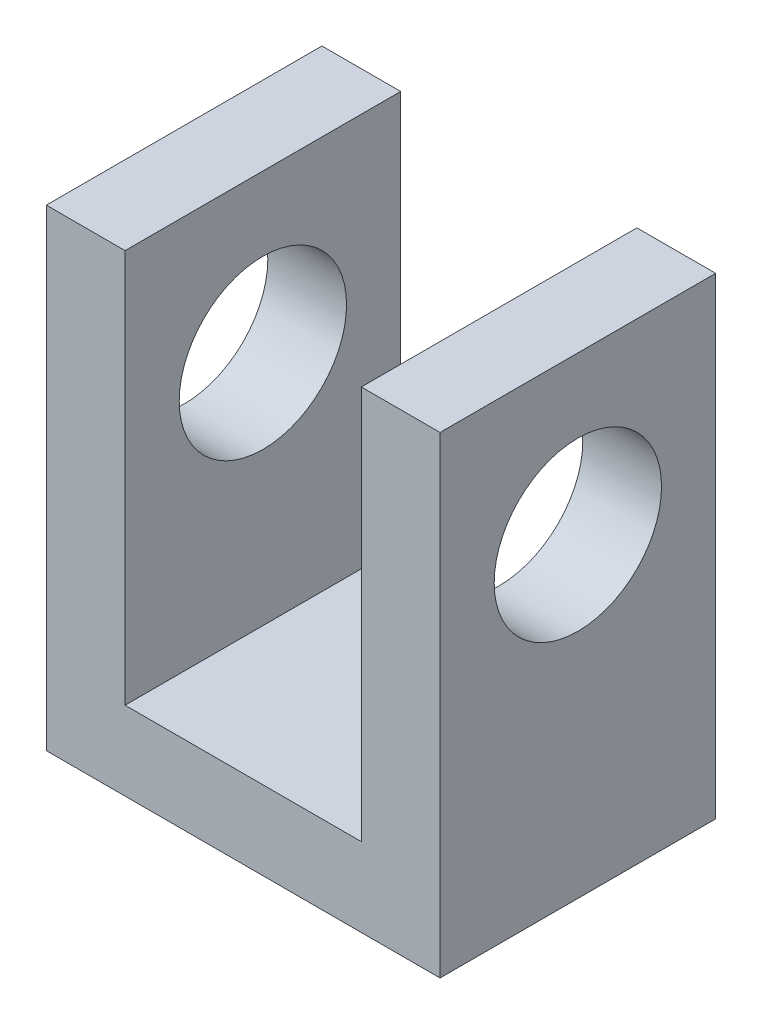
ISO-10303-21;
HEADER;
FILE_DESCRIPTION(('STEP AP214'),'2;1');
FILE_NAME('part.step','',(''),(''),'','','');
FILE_SCHEMA(('AUTOMOTIVE_DESIGN { 1 0 10303 214 1 1 1 1 }'));
ENDSEC;
DATA;
#1=APPLICATION_CONTEXT('core data for automotive mechanical design processes');
#2=APPLICATION_PROTOCOL_DEFINITION('international standard','automotive_design',2000,#1);
#3=PRODUCT_CONTEXT('',#1,'mechanical');
#4=PRODUCT('Part','Part','',(#3));
#5=PRODUCT_RELATED_PRODUCT_CATEGORY('part','',(#4));
#6=PRODUCT_DEFINITION_FORMATION('','',#4);
#7=PRODUCT_DEFINITION_CONTEXT('part definition',#1,'design');
#8=PRODUCT_DEFINITION('design','',#6,#7);
#9=PRODUCT_DEFINITION_SHAPE('','',#8);
#10=(LENGTH_UNIT() NAMED_UNIT(*) SI_UNIT(.MILLI.,.METRE.));
#11=(NAMED_UNIT(*) PLANE_ANGLE_UNIT() SI_UNIT($,.RADIAN.));
#12=(NAMED_UNIT(*) SI_UNIT($,.STERADIAN.) SOLID_ANGLE_UNIT());
#13=UNCERTAINTY_MEASURE_WITH_UNIT(LENGTH_MEASURE(1.E-05),#10,'distance_accuracy_value','');
#14=(GEOMETRIC_REPRESENTATION_CONTEXT(3) GLOBAL_UNCERTAINTY_ASSIGNED_CONTEXT((#13)) GLOBAL_UNIT_ASSIGNED_CONTEXT((#10,
#11,#12)) REPRESENTATION_CONTEXT('',''));
#15=CARTESIAN_POINT('',(0.,0.,0.));
#16=DIRECTION('',(0.,0.,1.));
#17=DIRECTION('',(1.,0.,0.));
#18=AXIS2_PLACEMENT_3D('',#15,#16,#17);
#19=CARTESIAN_POINT('',(0.,12.,0.));
#20=DIRECTION('',(0.,0.,-1.));
#21=DIRECTION('',(-1.,0.,0.));
#22=AXIS2_PLACEMENT_3D('',#19,#20,#21);
#23=PLANE('',#22);
#24=DIRECTION('',(0.,1.,0.));
#25=VECTOR('',#24,1.);
#26=CARTESIAN_POINT('',(8.,2.,0.));
#27=LINE('',#26,#25);
#28=CARTESIAN_POINT('',(8.,2.,0.));
#29=VERTEX_POINT('',#28);
#30=CARTESIAN_POINT('',(8.,12.,0.));
#31=VERTEX_POINT('',#30);
#32=EDGE_CURVE('E126',#29,#31,#27,.T.);
#33=ORIENTED_EDGE('',*,*,#32,.F.);
#34=DIRECTION('',(1.,0.,0.));
#35=VECTOR('',#34,1.);
#36=CARTESIAN_POINT('',(0.,2.,0.));
#37=LINE('',#36,#35);
#38=CARTESIAN_POINT('',(2.,2.,0.));
#39=VERTEX_POINT('',#38);
#40=EDGE_CURVE('E114',#39,#29,#37,.T.);
#41=ORIENTED_EDGE('',*,*,#40,.F.);
#42=DIRECTION('',(0.,1.,0.));
#43=VECTOR('',#42,1.);
#44=CARTESIAN_POINT('',(2.,2.,0.));
#45=LINE('',#44,#43);
#46=CARTESIAN_POINT('',(2.,12.,0.));
#47=VERTEX_POINT('',#46);
#48=EDGE_CURVE('E110',#39,#47,#45,.T.);
#49=ORIENTED_EDGE('',*,*,#48,.T.);
#50=DIRECTION('',(1.,0.,0.));
#51=VECTOR('',#50,1.);
#52=CARTESIAN_POINT('',(0.,12.,0.));
#53=LINE('',#52,#51);
#54=CARTESIAN_POINT('',(0.,12.,0.));
#55=VERTEX_POINT('',#54);
#56=EDGE_CURVE('E86',#55,#47,#53,.T.);
#57=ORIENTED_EDGE('',*,*,#56,.F.);
#58=DIRECTION('',(0.,-1.,0.));
#59=VECTOR('',#58,1.);
#60=CARTESIAN_POINT('',(0.,12.,0.));
#61=LINE('',#60,#59);
#62=CARTESIAN_POINT('',(0.,0.,0.));
#63=VERTEX_POINT('',#62);
#64=EDGE_CURVE('E11',#55,#63,#61,.T.);
#65=ORIENTED_EDGE('',*,*,#64,.T.);
#66=DIRECTION('',(1.,0.,0.));
#67=VECTOR('',#66,1.);
#68=CARTESIAN_POINT('',(0.,0.,0.));
#69=LINE('',#68,#67);
#70=CARTESIAN_POINT('',(10.,0.,0.));
#71=VERTEX_POINT('',#70);
#72=EDGE_CURVE('E144',#63,#71,#69,.T.);
#73=ORIENTED_EDGE('',*,*,#72,.T.);
#74=DIRECTION('',(0.,-1.,0.));
#75=VECTOR('',#74,1.);
#76=CARTESIAN_POINT('',(10.,12.,0.));
#77=LINE('',#76,#75);
#78=CARTESIAN_POINT('',(10.,12.,0.));
#79=VERTEX_POINT('',#78);
#80=EDGE_CURVE('E42',#79,#71,#77,.T.);
#81=ORIENTED_EDGE('',*,*,#80,.F.);
#82=EDGE_CURVE('E133',#31,#79,#53,.T.);
#83=ORIENTED_EDGE('',*,*,#82,.F.);
#84=EDGE_LOOP('',(#33,#41,#49,#57,#65,#73,#81,#83));
#85=FACE_BOUND('',#84,.T.);
#86=ADVANCED_FACE('F33',(#85),#23,.F.);
#87=CARTESIAN_POINT('',(0.,12.,-7.));
#88=DIRECTION('',(0.,0.,1.));
#89=DIRECTION('',(1.,0.,0.));
#90=AXIS2_PLACEMENT_3D('',#87,#88,#89);
#91=PLANE('',#90);
#92=DIRECTION('',(0.,1.,0.));
#93=VECTOR('',#92,1.);
#94=CARTESIAN_POINT('',(8.,2.,-7.));
#95=LINE('',#94,#93);
#96=CARTESIAN_POINT('',(8.,2.,-7.));
#97=VERTEX_POINT('',#96);
#98=CARTESIAN_POINT('',(8.,12.,-7.));
#99=VERTEX_POINT('',#98);
#100=EDGE_CURVE('E145',#97,#99,#95,.T.);
#101=ORIENTED_EDGE('',*,*,#100,.T.);
#102=DIRECTION('',(-1.,0.,0.));
#103=VECTOR('',#102,1.);
#104=CARTESIAN_POINT('',(0.,12.,-7.));
#105=LINE('',#104,#103);
#106=CARTESIAN_POINT('',(10.,12.,-7.));
#107=VERTEX_POINT('',#106);
#108=EDGE_CURVE('E137',#107,#99,#105,.T.);
#109=ORIENTED_EDGE('',*,*,#108,.F.);
#110=DIRECTION('',(0.,-1.,0.));
#111=VECTOR('',#110,1.);
#112=CARTESIAN_POINT('',(10.,12.,-7.));
#113=LINE('',#112,#111);
#114=CARTESIAN_POINT('',(10.,0.,-7.));
#115=VERTEX_POINT('',#114);
#116=EDGE_CURVE('E151',#107,#115,#113,.T.);
#117=ORIENTED_EDGE('',*,*,#116,.T.);
#118=DIRECTION('',(-1.,0.,0.));
#119=VECTOR('',#118,1.);
#120=CARTESIAN_POINT('',(0.,0.,-7.));
#121=LINE('',#120,#119);
#122=CARTESIAN_POINT('',(0.,0.,-7.));
#123=VERTEX_POINT('',#122);
#124=EDGE_CURVE('E79',#115,#123,#121,.T.);
#125=ORIENTED_EDGE('',*,*,#124,.T.);
#126=DIRECTION('',(0.,-1.,0.));
#127=VECTOR('',#126,1.);
#128=CARTESIAN_POINT('',(0.,12.,-7.));
#129=LINE('',#128,#127);
#130=CARTESIAN_POINT('',(0.,12.,-7.));
#131=VERTEX_POINT('',#130);
#132=EDGE_CURVE('E140',#131,#123,#129,.T.);
#133=ORIENTED_EDGE('',*,*,#132,.F.);
#134=CARTESIAN_POINT('',(2.,12.,-7.));
#135=VERTEX_POINT('',#134);
#136=EDGE_CURVE('E57',#135,#131,#105,.T.);
#137=ORIENTED_EDGE('',*,*,#136,.F.);
#138=DIRECTION('',(0.,1.,0.));
#139=VECTOR('',#138,1.);
#140=CARTESIAN_POINT('',(2.,2.,-7.));
#141=LINE('',#140,#139);
#142=CARTESIAN_POINT('',(2.,2.,-7.));
#143=VERTEX_POINT('',#142);
#144=EDGE_CURVE('E49',#143,#135,#141,.T.);
#145=ORIENTED_EDGE('',*,*,#144,.F.);
#146=DIRECTION('',(-1.,0.,0.));
#147=VECTOR('',#146,1.);
#148=CARTESIAN_POINT('',(0.,2.,-7.));
#149=LINE('',#148,#147);
#150=EDGE_CURVE('E115',#97,#143,#149,.T.);
#151=ORIENTED_EDGE('',*,*,#150,.F.);
#152=EDGE_LOOP('',(#101,#109,#117,#125,#133,#137,#145,#151));
#153=FACE_BOUND('',#152,.T.);
#154=ADVANCED_FACE('F124',(#153),#91,.F.);
#155=CARTESIAN_POINT('',(0.,12.,0.));
#156=DIRECTION('',(0.,-1.,0.));
#157=DIRECTION('',(0.,0.,-1.));
#158=AXIS2_PLACEMENT_3D('',#155,#156,#157);
#159=PLANE('',#158);
#160=DIRECTION('',(0.,0.,1.));
#161=VECTOR('',#160,1.);
#162=CARTESIAN_POINT('',(8.,12.,0.));
#163=LINE('',#162,#161);
#164=EDGE_CURVE('E122',#99,#31,#163,.T.);
#165=ORIENTED_EDGE('',*,*,#164,.T.);
#166=ORIENTED_EDGE('',*,*,#82,.T.);
#167=DIRECTION('',(0.,0.,-1.));
#168=VECTOR('',#167,1.);
#169=CARTESIAN_POINT('',(10.,12.,0.));
#170=LINE('',#169,#168);
#171=EDGE_CURVE('E135',#79,#107,#170,.T.);
#172=ORIENTED_EDGE('',*,*,#171,.T.);
#173=ORIENTED_EDGE('',*,*,#108,.T.);
#174=EDGE_LOOP('',(#165,#166,#172,#173));
#175=FACE_BOUND('',#174,.T.);
#176=ADVANCED_FACE('F181',(#175),#159,.F.);
#177=CARTESIAN_POINT('',(0.,12.,0.));
#178=DIRECTION('',(1.,0.,0.));
#179=DIRECTION('',(0.,0.,-1.));
#180=AXIS2_PLACEMENT_3D('',#177,#178,#179);
#181=PLANE('',#180);
#182=CARTESIAN_POINT('',(0.,8.,-3.5));
#183=DIRECTION('',(1.,0.,0.));
#184=DIRECTION('',(0.,0.,-1.));
#185=AXIS2_PLACEMENT_3D('',#182,#183,#184);
#186=CIRCLE('',#185,2.125);
#187=CARTESIAN_POINT('',(0.,8.,-5.625));
#188=VERTEX_POINT('',#187);
#189=EDGE_CURVE('E217',#188,#188,#186,.T.);
#190=ORIENTED_EDGE('',*,*,#189,.T.);
#191=EDGE_LOOP('',(#190));
#192=FACE_BOUND('',#191,.T.);
#193=DIRECTION('',(0.,0.,1.));
#194=VECTOR('',#193,1.);
#195=CARTESIAN_POINT('',(0.,0.,0.));
#196=LINE('',#195,#194);
#197=EDGE_CURVE('E141',#123,#63,#196,.T.);
#198=ORIENTED_EDGE('',*,*,#197,.T.);
#199=ORIENTED_EDGE('',*,*,#64,.F.);
#200=DIRECTION('',(0.,0.,1.));
#201=VECTOR('',#200,1.);
#202=CARTESIAN_POINT('',(0.,12.,0.));
#203=LINE('',#202,#201);
#204=EDGE_CURVE('E131',#131,#55,#203,.T.);
#205=ORIENTED_EDGE('',*,*,#204,.F.);
#206=ORIENTED_EDGE('',*,*,#132,.T.);
#207=EDGE_LOOP('',(#198,#199,#205,#206));
#208=FACE_BOUND('',#207,.T.);
#209=ADVANCED_FACE('F35',(#192,#208),#181,.F.);
#210=CARTESIAN_POINT('',(10.,12.,0.));
#211=DIRECTION('',(-1.,0.,0.));
#212=DIRECTION('',(0.,0.,1.));
#213=AXIS2_PLACEMENT_3D('',#210,#211,#212);
#214=PLANE('',#213);
#215=CARTESIAN_POINT('',(10.,8.,-3.5));
#216=DIRECTION('',(1.,0.,0.));
#217=DIRECTION('',(0.,0.,-1.));
#218=AXIS2_PLACEMENT_3D('',#215,#216,#217);
#219=CIRCLE('',#218,2.125);
#220=CARTESIAN_POINT('',(10.,8.,-5.625));
#221=VERTEX_POINT('',#220);
#222=EDGE_CURVE('E216',#221,#221,#219,.T.);
#223=ORIENTED_EDGE('',*,*,#222,.F.);
#224=EDGE_LOOP('',(#223));
#225=FACE_BOUND('',#224,.T.);
#226=DIRECTION('',(0.,0.,-1.));
#227=VECTOR('',#226,1.);
#228=CARTESIAN_POINT('',(10.,0.,0.));
#229=LINE('',#228,#227);
#230=EDGE_CURVE('E147',#71,#115,#229,.T.);
#231=ORIENTED_EDGE('',*,*,#230,.T.);
#232=ORIENTED_EDGE('',*,*,#116,.F.);
#233=ORIENTED_EDGE('',*,*,#171,.F.);
#234=ORIENTED_EDGE('',*,*,#80,.T.);
#235=EDGE_LOOP('',(#231,#232,#233,#234));
#236=FACE_BOUND('',#235,.T.);
#237=ADVANCED_FACE('F158',(#225,#236),#214,.F.);
#238=ORIENTED_EDGE('',*,*,#56,.T.);
#239=DIRECTION('',(0.,0.,1.));
#240=VECTOR('',#239,1.);
#241=CARTESIAN_POINT('',(2.,12.,0.));
#242=LINE('',#241,#240);
#243=EDGE_CURVE('E168',#135,#47,#242,.T.);
#244=ORIENTED_EDGE('',*,*,#243,.F.);
#245=ORIENTED_EDGE('',*,*,#136,.T.);
#246=ORIENTED_EDGE('',*,*,#204,.T.);
#247=EDGE_LOOP('',(#238,#244,#245,#246));
#248=FACE_BOUND('',#247,.T.);
#249=ADVANCED_FACE('F167',(#248),#159,.F.);
#250=CARTESIAN_POINT('',(0.,0.,0.));
#251=DIRECTION('',(0.,-1.,0.));
#252=DIRECTION('',(0.,0.,-1.));
#253=AXIS2_PLACEMENT_3D('',#250,#251,#252);
#254=PLANE('',#253);
#255=ORIENTED_EDGE('',*,*,#197,.F.);
#256=ORIENTED_EDGE('',*,*,#124,.F.);
#257=ORIENTED_EDGE('',*,*,#230,.F.);
#258=ORIENTED_EDGE('',*,*,#72,.F.);
#259=EDGE_LOOP('',(#255,#256,#257,#258));
#260=FACE_BOUND('',#259,.T.);
#261=ADVANCED_FACE('F163',(#260),#254,.T.);
#262=CARTESIAN_POINT('',(8.,2.,0.));
#263=DIRECTION('',(-1.,0.,0.));
#264=DIRECTION('',(0.,0.,1.));
#265=AXIS2_PLACEMENT_3D('',#262,#263,#264);
#266=PLANE('',#265);
#267=CARTESIAN_POINT('',(8.,8.,-3.5));
#268=DIRECTION('',(-1.,0.,0.));
#269=DIRECTION('',(0.,0.,1.));
#270=AXIS2_PLACEMENT_3D('',#267,#268,#269);
#271=CIRCLE('',#270,2.125);
#272=CARTESIAN_POINT('',(8.,8.,-1.375));
#273=VERTEX_POINT('',#272);
#274=EDGE_CURVE('E169',#273,#273,#271,.T.);
#275=ORIENTED_EDGE('',*,*,#274,.F.);
#276=EDGE_LOOP('',(#275));
#277=FACE_BOUND('',#276,.T.);
#278=ORIENTED_EDGE('',*,*,#164,.F.);
#279=ORIENTED_EDGE('',*,*,#100,.F.);
#280=DIRECTION('',(0.,0.,1.));
#281=VECTOR('',#280,1.);
#282=CARTESIAN_POINT('',(8.,2.,0.));
#283=LINE('',#282,#281);
#284=EDGE_CURVE('E120',#97,#29,#283,.T.);
#285=ORIENTED_EDGE('',*,*,#284,.T.);
#286=ORIENTED_EDGE('',*,*,#32,.T.);
#287=EDGE_LOOP('',(#278,#279,#285,#286));
#288=FACE_BOUND('',#287,.T.);
#289=ADVANCED_FACE('F179',(#277,#288),#266,.T.);
#290=CARTESIAN_POINT('',(2.,2.,0.));
#291=DIRECTION('',(-1.,0.,0.));
#292=DIRECTION('',(0.,0.,1.));
#293=AXIS2_PLACEMENT_3D('',#290,#291,#292);
#294=PLANE('',#293);
#295=CARTESIAN_POINT('',(2.,8.,-3.5));
#296=DIRECTION('',(-1.,0.,0.));
#297=DIRECTION('',(0.,0.,1.));
#298=AXIS2_PLACEMENT_3D('',#295,#296,#297);
#299=CIRCLE('',#298,2.125);
#300=CARTESIAN_POINT('',(2.,8.,-1.375));
#301=VERTEX_POINT('',#300);
#302=EDGE_CURVE('E37',#301,#301,#299,.T.);
#303=ORIENTED_EDGE('',*,*,#302,.T.);
#304=EDGE_LOOP('',(#303));
#305=FACE_BOUND('',#304,.T.);
#306=ORIENTED_EDGE('',*,*,#243,.T.);
#307=ORIENTED_EDGE('',*,*,#48,.F.);
#308=DIRECTION('',(0.,0.,1.));
#309=VECTOR('',#308,1.);
#310=CARTESIAN_POINT('',(2.,2.,0.));
#311=LINE('',#310,#309);
#312=EDGE_CURVE('E107',#143,#39,#311,.T.);
#313=ORIENTED_EDGE('',*,*,#312,.F.);
#314=ORIENTED_EDGE('',*,*,#144,.T.);
#315=EDGE_LOOP('',(#306,#307,#313,#314));
#316=FACE_BOUND('',#315,.T.);
#317=ADVANCED_FACE('F109',(#305,#316),#294,.F.);
#318=CARTESIAN_POINT('',(0.,2.,0.));
#319=DIRECTION('',(0.,1.,0.));
#320=DIRECTION('',(0.,0.,1.));
#321=AXIS2_PLACEMENT_3D('',#318,#319,#320);
#322=PLANE('',#321);
#323=ORIENTED_EDGE('',*,*,#150,.T.);
#324=ORIENTED_EDGE('',*,*,#312,.T.);
#325=ORIENTED_EDGE('',*,*,#40,.T.);
#326=ORIENTED_EDGE('',*,*,#284,.F.);
#327=EDGE_LOOP('',(#323,#324,#325,#326));
#328=FACE_BOUND('',#327,.T.);
#329=ADVANCED_FACE('F119',(#328),#322,.T.);
#330=CARTESIAN_POINT('',(0.,8.,-3.5));
#331=DIRECTION('',(1.,0.,0.));
#332=DIRECTION('',(0.,0.,-1.));
#333=AXIS2_PLACEMENT_3D('',#330,#331,#332);
#334=CYLINDRICAL_SURFACE('',#333,2.125);
#335=ORIENTED_EDGE('',*,*,#189,.F.);
#336=EDGE_LOOP('',(#335));
#337=FACE_BOUND('',#336,.T.);
#338=ORIENTED_EDGE('',*,*,#302,.F.);
#339=EDGE_LOOP('',(#338));
#340=FACE_BOUND('',#339,.T.);
#341=ADVANCED_FACE('F204',(#337,#340),#334,.F.);
#342=ORIENTED_EDGE('',*,*,#274,.T.);
#343=EDGE_LOOP('',(#342));
#344=FACE_BOUND('',#343,.T.);
#345=ORIENTED_EDGE('',*,*,#222,.T.);
#346=EDGE_LOOP('',(#345));
#347=FACE_BOUND('',#346,.T.);
#348=ADVANCED_FACE('F205',(#344,#347),#334,.F.);
#349=CLOSED_SHELL('',(#86,#154,#176,#209,#237,#249,#261,#289,#317,#329,#341,#348));
#350=MANIFOLD_SOLID_BREP('B2',#349);
#351=ADVANCED_BREP_SHAPE_REPRESENTATION('',(#18,#350),#14);
#352=SHAPE_DEFINITION_REPRESENTATION(#9,#351);
ENDSEC;
END-ISO-10303-21;
